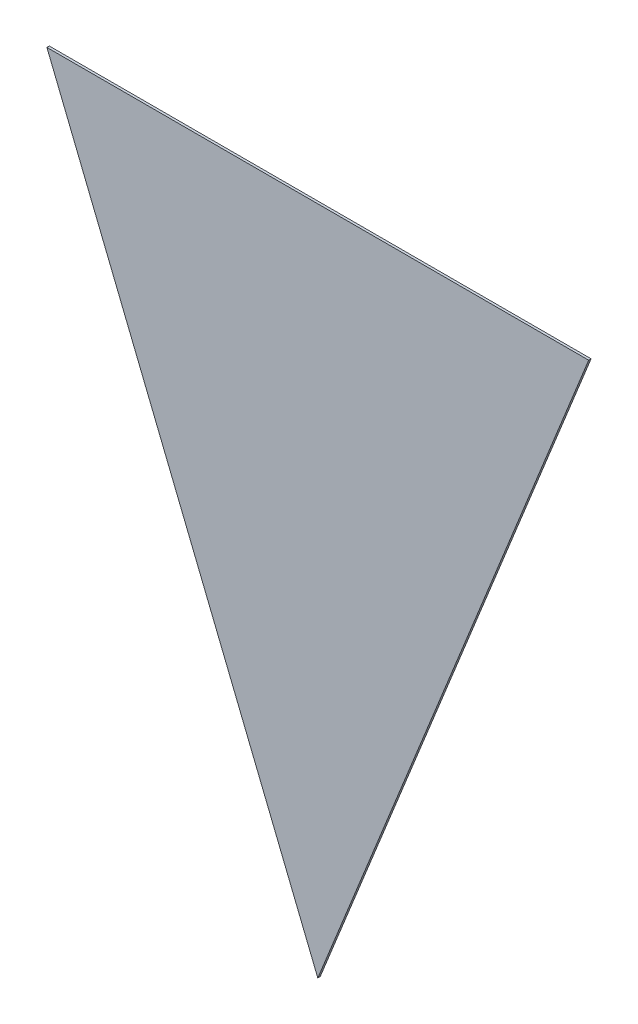
ISO-10303-21;
HEADER;
FILE_DESCRIPTION(('STEP AP214'),'2;1');
FILE_NAME('part.step','',(''),(''),'','','');
FILE_SCHEMA(('AUTOMOTIVE_DESIGN { 1 0 10303 214 1 1 1 1 }'));
ENDSEC;
DATA;
#1=APPLICATION_CONTEXT('core data for automotive mechanical design processes');
#2=APPLICATION_PROTOCOL_DEFINITION('international standard','automotive_design',2000,#1);
#3=PRODUCT_CONTEXT('',#1,'mechanical');
#4=PRODUCT('Part','Part','',(#3));
#5=PRODUCT_RELATED_PRODUCT_CATEGORY('part','',(#4));
#6=PRODUCT_DEFINITION_FORMATION('','',#4);
#7=PRODUCT_DEFINITION_CONTEXT('part definition',#1,'design');
#8=PRODUCT_DEFINITION('design','',#6,#7);
#9=PRODUCT_DEFINITION_SHAPE('','',#8);
#10=(LENGTH_UNIT() NAMED_UNIT(*) SI_UNIT(.MILLI.,.METRE.));
#11=(NAMED_UNIT(*) PLANE_ANGLE_UNIT() SI_UNIT($,.RADIAN.));
#12=(NAMED_UNIT(*) SI_UNIT($,.STERADIAN.) SOLID_ANGLE_UNIT());
#13=UNCERTAINTY_MEASURE_WITH_UNIT(LENGTH_MEASURE(1.E-05),#10,'distance_accuracy_value','');
#14=(GEOMETRIC_REPRESENTATION_CONTEXT(3) GLOBAL_UNCERTAINTY_ASSIGNED_CONTEXT((#13)) GLOBAL_UNIT_ASSIGNED_CONTEXT((#10,
#11,#12)) REPRESENTATION_CONTEXT('',''));
#15=CARTESIAN_POINT('',(0.,0.,0.));
#16=DIRECTION('',(0.,0.,1.));
#17=DIRECTION('',(1.,0.,0.));
#18=AXIS2_PLACEMENT_3D('',#15,#16,#17);
#19=CARTESIAN_POINT('',(0.599482734472,-0.1065503398114,0.0009));
#20=DIRECTION('',(0.,0.,-1.));
#21=DIRECTION('',(-1.,0.,0.));
#22=AXIS2_PLACEMENT_3D('',#19,#20,#21);
#23=PLANE('',#22);
#24=DIRECTION('',(-0.374606593415143,-0.927183854567098,0.));
#25=VECTOR('',#24,1.);
#26=CARTESIAN_POINT('',(0.6106864504891,-0.078820169588,0.0009));
#27=LINE('',#26,#25);
#28=CARTESIAN_POINT('',(0.6106864504891,-0.078820169588,0.0009));
#29=VERTEX_POINT('',#28);
#30=CARTESIAN_POINT('',(0.599482734472,-0.1065503398114,0.0009));
#31=VERTEX_POINT('',#30);
#32=EDGE_CURVE('E11',#29,#31,#27,.T.);
#33=ORIENTED_EDGE('',*,*,#32,.T.);
#34=DIRECTION('',(-0.374606593415144,0.927183854567098,0.));
#35=VECTOR('',#34,1.);
#36=CARTESIAN_POINT('',(0.599482734472,-0.1065503398114,0.0009));
#37=LINE('',#36,#35);
#38=CARTESIAN_POINT('',(0.5882790184549,-0.078820169588,0.0009));
#39=VERTEX_POINT('',#38);
#40=EDGE_CURVE('E24',#31,#39,#37,.T.);
#41=ORIENTED_EDGE('',*,*,#40,.T.);
#42=DIRECTION('',(1.,0.,0.));
#43=VECTOR('',#42,1.);
#44=CARTESIAN_POINT('',(0.5882790184549,-0.078820169588,0.0009));
#45=LINE('',#44,#43);
#46=EDGE_CURVE('E62',#39,#29,#45,.T.);
#47=ORIENTED_EDGE('',*,*,#46,.T.);
#48=EDGE_LOOP('',(#33,#41,#47));
#49=FACE_BOUND('',#48,.T.);
#50=ADVANCED_FACE('F17',(#49),#23,.T.);
#51=CARTESIAN_POINT('',(0.60508459248055,-0.0926852546997,0.0009));
#52=DIRECTION('',(0.927183854567098,-0.374606593415143,0.));
#53=DIRECTION('',(0.,0.,-1.));
#54=AXIS2_PLACEMENT_3D('',#51,#52,#53);
#55=PLANE('',#54);
#56=DIRECTION('',(0.374606593415143,0.927183854567098,0.));
#57=VECTOR('',#56,1.);
#58=CARTESIAN_POINT('',(0.599482734472,-0.1065503398114,0.001));
#59=LINE('',#58,#57);
#60=CARTESIAN_POINT('',(0.599482734472,-0.1065503398114,0.001));
#61=VERTEX_POINT('',#60);
#62=CARTESIAN_POINT('',(0.6106864504891,-0.078820169588,0.001));
#63=VERTEX_POINT('',#62);
#64=EDGE_CURVE('E53',#61,#63,#59,.T.);
#65=ORIENTED_EDGE('',*,*,#64,.F.);
#66=DIRECTION('',(0.,0.,-1.));
#67=VECTOR('',#66,1.);
#68=CARTESIAN_POINT('',(0.599482734472,-0.1065503398114,0.001));
#69=LINE('',#68,#67);
#70=EDGE_CURVE('E67',#61,#31,#69,.T.);
#71=ORIENTED_EDGE('',*,*,#70,.T.);
#72=ORIENTED_EDGE('',*,*,#32,.F.);
#73=DIRECTION('',(0.,0.,-1.));
#74=VECTOR('',#73,1.);
#75=CARTESIAN_POINT('',(0.6106864504891,-0.078820169588,0.001));
#76=LINE('',#75,#74);
#77=EDGE_CURVE('E56',#63,#29,#76,.T.);
#78=ORIENTED_EDGE('',*,*,#77,.F.);
#79=EDGE_LOOP('',(#65,#71,#72,#78));
#80=FACE_BOUND('',#79,.T.);
#81=ADVANCED_FACE('F73',(#80),#55,.T.);
#82=CARTESIAN_POINT('',(0.599482734472,-0.078820169588,0.0009));
#83=DIRECTION('',(0.,1.,0.));
#84=DIRECTION('',(0.,0.,1.));
#85=AXIS2_PLACEMENT_3D('',#82,#83,#84);
#86=PLANE('',#85);
#87=DIRECTION('',(-1.,0.,0.));
#88=VECTOR('',#87,1.);
#89=CARTESIAN_POINT('',(0.6106864504891,-0.078820169588,0.001));
#90=LINE('',#89,#88);
#91=CARTESIAN_POINT('',(0.5882790184549,-0.078820169588,0.001));
#92=VERTEX_POINT('',#91);
#93=EDGE_CURVE('E48',#63,#92,#90,.T.);
#94=ORIENTED_EDGE('',*,*,#93,.F.);
#95=ORIENTED_EDGE('',*,*,#77,.T.);
#96=ORIENTED_EDGE('',*,*,#46,.F.);
#97=DIRECTION('',(0.,0.,-1.));
#98=VECTOR('',#97,1.);
#99=CARTESIAN_POINT('',(0.5882790184549,-0.078820169588,0.001));
#100=LINE('',#99,#98);
#101=EDGE_CURVE('E57',#92,#39,#100,.T.);
#102=ORIENTED_EDGE('',*,*,#101,.F.);
#103=EDGE_LOOP('',(#94,#95,#96,#102));
#104=FACE_BOUND('',#103,.T.);
#105=ADVANCED_FACE('F61',(#104),#86,.T.);
#106=CARTESIAN_POINT('',(0.59388087646345,-0.0926852546997,0.0009));
#107=DIRECTION('',(-0.927183854567098,-0.374606593415144,0.));
#108=DIRECTION('',(0.,0.,1.));
#109=AXIS2_PLACEMENT_3D('',#106,#107,#108);
#110=PLANE('',#109);
#111=DIRECTION('',(0.374606593415144,-0.927183854567098,0.));
#112=VECTOR('',#111,1.);
#113=CARTESIAN_POINT('',(0.5882790184549,-0.078820169588,0.001));
#114=LINE('',#113,#112);
#115=EDGE_CURVE('E52',#92,#61,#114,.T.);
#116=ORIENTED_EDGE('',*,*,#115,.F.);
#117=ORIENTED_EDGE('',*,*,#101,.T.);
#118=ORIENTED_EDGE('',*,*,#40,.F.);
#119=ORIENTED_EDGE('',*,*,#70,.F.);
#120=EDGE_LOOP('',(#116,#117,#118,#119));
#121=FACE_BOUND('',#120,.T.);
#122=ADVANCED_FACE('F66',(#121),#110,.T.);
#123=CARTESIAN_POINT('',(0.599482734472,-0.1065503398114,0.001));
#124=DIRECTION('',(0.,0.,-1.));
#125=DIRECTION('',(-1.,0.,0.));
#126=AXIS2_PLACEMENT_3D('',#123,#124,#125);
#127=PLANE('',#126);
#128=ORIENTED_EDGE('',*,*,#93,.T.);
#129=ORIENTED_EDGE('',*,*,#115,.T.);
#130=ORIENTED_EDGE('',*,*,#64,.T.);
#131=EDGE_LOOP('',(#128,#129,#130));
#132=FACE_BOUND('',#131,.T.);
#133=ADVANCED_FACE('F50',(#132),#127,.F.);
#134=CLOSED_SHELL('',(#50,#81,#105,#122,#133));
#135=MANIFOLD_SOLID_BREP('B1',#134);
#136=ADVANCED_BREP_SHAPE_REPRESENTATION('',(#18,#135),#14);
#137=SHAPE_DEFINITION_REPRESENTATION(#9,#136);
ENDSEC;
END-ISO-10303-21;
